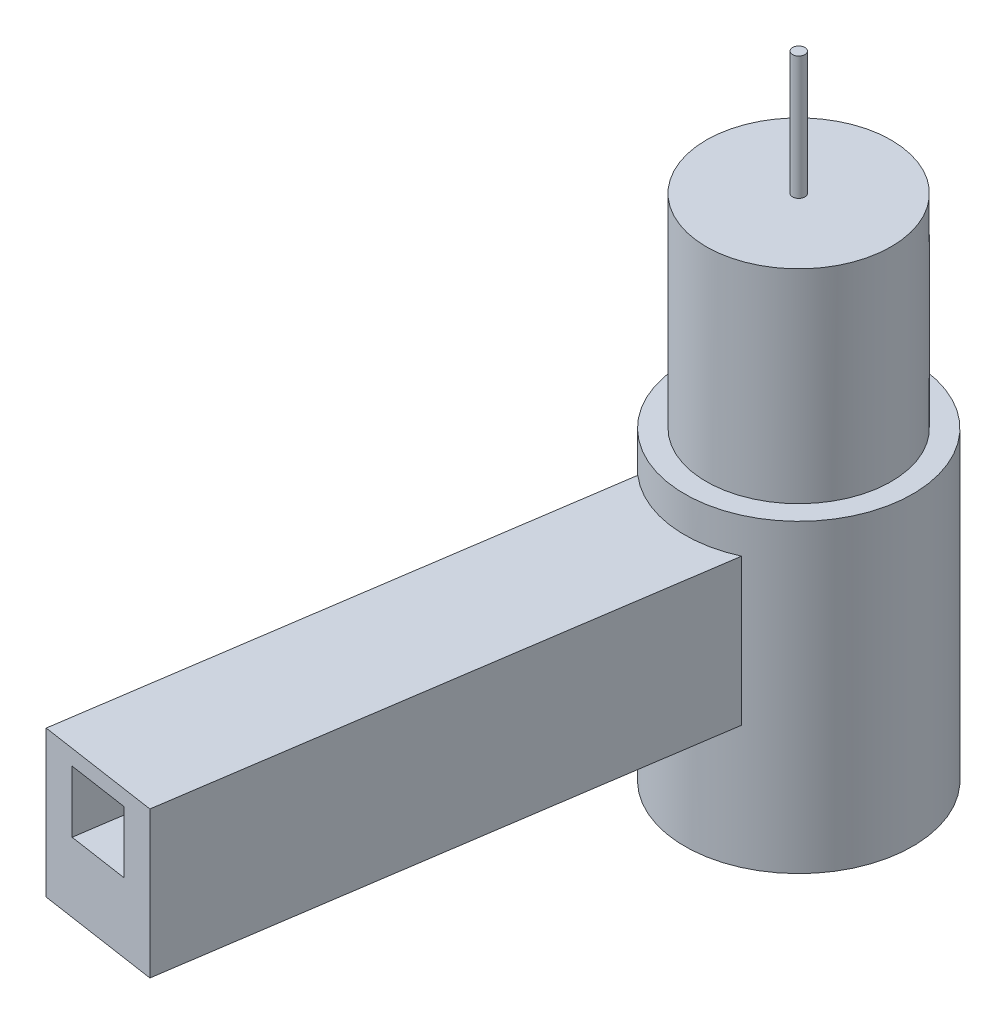
ISO-10303-21;
HEADER;
FILE_DESCRIPTION(('STEP AP214'),'2;1');
FILE_NAME('part.step','',(''),(''),'','','');
FILE_SCHEMA(('AUTOMOTIVE_DESIGN { 1 0 10303 214 1 1 1 1 }'));
ENDSEC;
DATA;
#1=APPLICATION_CONTEXT('core data for automotive mechanical design processes');
#2=APPLICATION_PROTOCOL_DEFINITION('international standard','automotive_design',2000,#1);
#3=PRODUCT_CONTEXT('',#1,'mechanical');
#4=PRODUCT('Part','Part','',(#3));
#5=PRODUCT_RELATED_PRODUCT_CATEGORY('part','',(#4));
#6=PRODUCT_DEFINITION_FORMATION('','',#4);
#7=PRODUCT_DEFINITION_CONTEXT('part definition',#1,'design');
#8=PRODUCT_DEFINITION('design','',#6,#7);
#9=PRODUCT_DEFINITION_SHAPE('','',#8);
#10=(LENGTH_UNIT() NAMED_UNIT(*) SI_UNIT(.MILLI.,.METRE.));
#11=(NAMED_UNIT(*) PLANE_ANGLE_UNIT() SI_UNIT($,.RADIAN.));
#12=(NAMED_UNIT(*) SI_UNIT($,.STERADIAN.) SOLID_ANGLE_UNIT());
#13=UNCERTAINTY_MEASURE_WITH_UNIT(LENGTH_MEASURE(1.E-05),#10,'distance_accuracy_value','');
#14=(GEOMETRIC_REPRESENTATION_CONTEXT(3) GLOBAL_UNCERTAINTY_ASSIGNED_CONTEXT((#13)) GLOBAL_UNIT_ASSIGNED_CONTEXT((#10,
#11,#12)) REPRESENTATION_CONTEXT('',''));
#15=CARTESIAN_POINT('',(0.,0.,0.));
#16=DIRECTION('',(0.,0.,1.));
#17=DIRECTION('',(1.,0.,0.));
#18=AXIS2_PLACEMENT_3D('',#15,#16,#17);
#19=CARTESIAN_POINT('',(0.,16.5,0.));
#20=DIRECTION('',(0.,1.,0.));
#21=DIRECTION('',(0.,0.,1.));
#22=AXIS2_PLACEMENT_3D('',#19,#20,#21);
#23=PLANE('',#22);
#24=CARTESIAN_POINT('',(0.,16.5,0.));
#25=DIRECTION('',(0.,1.,0.));
#26=DIRECTION('',(0.,0.,1.));
#27=AXIS2_PLACEMENT_3D('',#24,#25,#26);
#28=CIRCLE('',#27,3.);
#29=CARTESIAN_POINT('',(0.,16.5,3.));
#30=VERTEX_POINT('',#29);
#31=EDGE_CURVE('E41',#30,#30,#28,.T.);
#32=ORIENTED_EDGE('',*,*,#31,.T.);
#33=EDGE_LOOP('',(#32));
#34=FACE_BOUND('',#33,.T.);
#35=CARTESIAN_POINT('',(0.,16.5,0.));
#36=DIRECTION('',(0.,1.,0.));
#37=DIRECTION('',(0.,0.,1.));
#38=AXIS2_PLACEMENT_3D('',#35,#36,#37);
#39=CIRCLE('',#38,0.2);
#40=CARTESIAN_POINT('',(0.,16.5,0.2));
#41=VERTEX_POINT('',#40);
#42=EDGE_CURVE('E134',#41,#41,#39,.T.);
#43=ORIENTED_EDGE('',*,*,#42,.F.);
#44=EDGE_LOOP('',(#43));
#45=FACE_BOUND('',#44,.T.);
#46=ADVANCED_FACE('F33',(#34,#45),#23,.T.);
#47=CARTESIAN_POINT('',(0.,16.5,0.));
#48=DIRECTION('',(0.,-1.,0.));
#49=DIRECTION('',(0.,0.,-1.));
#50=AXIS2_PLACEMENT_3D('',#47,#48,#49);
#51=CYLINDRICAL_SURFACE('',#50,3.);
#52=ORIENTED_EDGE('',*,*,#31,.F.);
#53=EDGE_LOOP('',(#52));
#54=FACE_BOUND('',#53,.T.);
#55=CARTESIAN_POINT('',(0.,9.9,0.));
#56=DIRECTION('',(0.,-1.,0.));
#57=DIRECTION('',(0.,0.,-1.));
#58=AXIS2_PLACEMENT_3D('',#55,#56,#57);
#59=CIRCLE('',#58,3.);
#60=CARTESIAN_POINT('',(0.,9.9,-3.));
#61=VERTEX_POINT('',#60);
#62=EDGE_CURVE('E11',#61,#61,#59,.T.);
#63=ORIENTED_EDGE('',*,*,#62,.F.);
#64=EDGE_LOOP('',(#63));
#65=FACE_BOUND('',#64,.T.);
#66=ADVANCED_FACE('F35',(#54,#65),#51,.T.);
#67=CARTESIAN_POINT('',(0.,9.9,0.));
#68=DIRECTION('',(0.,-1.,0.));
#69=DIRECTION('',(0.,0.,-1.));
#70=AXIS2_PLACEMENT_3D('',#67,#68,#69);
#71=PLANE('',#70);
#72=CARTESIAN_POINT('',(0.,9.9,0.));
#73=DIRECTION('',(0.,-1.,0.));
#74=DIRECTION('',(0.,0.,-1.));
#75=AXIS2_PLACEMENT_3D('',#72,#73,#74);
#76=CIRCLE('',#75,3.7);
#77=CARTESIAN_POINT('',(0.,9.9,-3.7));
#78=VERTEX_POINT('',#77);
#79=EDGE_CURVE('E173',#78,#78,#76,.T.);
#80=ORIENTED_EDGE('',*,*,#79,.F.);
#81=EDGE_LOOP('',(#80));
#82=FACE_BOUND('',#81,.T.);
#83=ORIENTED_EDGE('',*,*,#62,.T.);
#84=EDGE_LOOP('',(#83));
#85=FACE_BOUND('',#84,.T.);
#86=ADVANCED_FACE('F184',(#82,#85),#71,.F.);
#87=CARTESIAN_POINT('',(0.,9.9,0.));
#88=DIRECTION('',(0.,-1.,0.));
#89=DIRECTION('',(0.,0.,-1.));
#90=AXIS2_PLACEMENT_3D('',#87,#88,#89);
#91=CYLINDRICAL_SURFACE('',#90,3.7);
#92=CARTESIAN_POINT('',(0.,4.,0.));
#93=DIRECTION('',(0.,1.,0.));
#94=DIRECTION('',(0.,0.,-1.));
#95=AXIS2_PLACEMENT_3D('',#92,#93,#94);
#96=CIRCLE('',#95,3.7);
#97=CARTESIAN_POINT('',(-2.4381167249235,4.,2.783089440828));
#98=VERTEX_POINT('',#97);
#99=CARTESIAN_POINT('',(1.51795255805528,4.,3.37428807772742));
#100=VERTEX_POINT('',#99);
#101=EDGE_CURVE('E149',#98,#100,#96,.T.);
#102=ORIENTED_EDGE('',*,*,#101,.F.);
#103=DIRECTION('',(0.,1.,0.));
#104=VECTOR('',#103,1.);
#105=CARTESIAN_POINT('',(-2.4381167249235,4.,2.783089440828));
#106=LINE('',#105,#104);
#107=CARTESIAN_POINT('',(-2.4381167249235,8.75,2.783089440828));
#108=VERTEX_POINT('',#107);
#109=EDGE_CURVE('E166',#98,#108,#106,.T.);
#110=ORIENTED_EDGE('',*,*,#109,.T.);
#111=CARTESIAN_POINT('',(0.,8.75,0.));
#112=DIRECTION('',(0.,1.,0.));
#113=DIRECTION('',(0.,0.,-1.));
#114=AXIS2_PLACEMENT_3D('',#111,#112,#113);
#115=CIRCLE('',#114,3.7);
#116=CARTESIAN_POINT('',(1.51795255805528,8.75,3.37428807772743));
#117=VERTEX_POINT('',#116);
#118=EDGE_CURVE('E158',#108,#117,#115,.T.);
#119=ORIENTED_EDGE('',*,*,#118,.T.);
#120=DIRECTION('',(0.,1.,0.));
#121=VECTOR('',#120,1.);
#122=CARTESIAN_POINT('',(1.51795255805528,4.,3.37428807772742));
#123=LINE('',#122,#121);
#124=EDGE_CURVE('E164',#100,#117,#123,.T.);
#125=ORIENTED_EDGE('',*,*,#124,.F.);
#126=EDGE_LOOP('',(#102,#110,#119,#125));
#127=FACE_BOUND('',#126,.T.);
#128=ORIENTED_EDGE('',*,*,#79,.T.);
#129=EDGE_LOOP('',(#128));
#130=FACE_BOUND('',#129,.T.);
#131=CARTESIAN_POINT('',(0.,0.,0.));
#132=DIRECTION('',(0.,-1.,0.));
#133=DIRECTION('',(0.,0.,-1.));
#134=AXIS2_PLACEMENT_3D('',#131,#132,#133);
#135=CIRCLE('',#134,3.7);
#136=CARTESIAN_POINT('',(0.,0.,-3.7));
#137=VERTEX_POINT('',#136);
#138=EDGE_CURVE('E172',#137,#137,#135,.T.);
#139=ORIENTED_EDGE('',*,*,#138,.F.);
#140=EDGE_LOOP('',(#139));
#141=FACE_BOUND('',#140,.T.);
#142=ADVANCED_FACE('F188',(#127,#130,#141),#91,.T.);
#143=CARTESIAN_POINT('',(0.,0.,0.));
#144=DIRECTION('',(0.,1.,0.));
#145=DIRECTION('',(0.,0.,1.));
#146=AXIS2_PLACEMENT_3D('',#143,#144,#145);
#147=PLANE('',#146);
#148=ORIENTED_EDGE('',*,*,#138,.T.);
#149=EDGE_LOOP('',(#148));
#150=FACE_BOUND('',#149,.T.);
#151=ADVANCED_FACE('F194',(#150),#147,.F.);
#152=CARTESIAN_POINT('',(-4.93402782598654,4.,19.4847470964442));
#153=DIRECTION('',(0.147799659224858,0.,-0.989017320744696));
#154=DIRECTION('',(-0.989017320744696,0.,-0.147799659224858));
#155=AXIS2_PLACEMENT_3D('',#152,#153,#154);
#156=PLANE('',#155);
#157=DIRECTION('',(0.,-1.,0.));
#158=VECTOR('',#157,1.);
#159=CARTESIAN_POINT('',(-1.96697586375245,4.,19.9281460741188));
#160=LINE('',#159,#158);
#161=CARTESIAN_POINT('',(-1.96697586375245,8.25,19.9281460741188));
#162=VERTEX_POINT('',#161);
#163=CARTESIAN_POINT('',(-1.96697586375245,6.25,19.9281460741188));
#164=VERTEX_POINT('',#163);
#165=EDGE_CURVE('E128',#162,#164,#160,.T.);
#166=ORIENTED_EDGE('',*,*,#165,.T.);
#167=DIRECTION('',(0.989017320744696,0.,0.147799659224858));
#168=VECTOR('',#167,1.);
#169=CARTESIAN_POINT('',(-4.93402782598654,6.25,19.4847470964442));
#170=LINE('',#169,#168);
#171=CARTESIAN_POINT('',(-3.94501050524184,6.25,19.6325467556691));
#172=VERTEX_POINT('',#171);
#173=EDGE_CURVE('E48',#172,#164,#170,.T.);
#174=ORIENTED_EDGE('',*,*,#173,.F.);
#175=DIRECTION('',(0.,-1.,0.));
#176=VECTOR('',#175,1.);
#177=CARTESIAN_POINT('',(-3.94501050524184,4.,19.6325467556691));
#178=LINE('',#177,#176);
#179=CARTESIAN_POINT('',(-3.94501050524184,8.25,19.6325467556691));
#180=VERTEX_POINT('',#179);
#181=EDGE_CURVE('E119',#180,#172,#178,.T.);
#182=ORIENTED_EDGE('',*,*,#181,.F.);
#183=DIRECTION('',(0.989017320744696,0.,0.147799659224858));
#184=VECTOR('',#183,1.);
#185=CARTESIAN_POINT('',(-4.93402782598654,8.25,19.4847470964442));
#186=LINE('',#185,#184);
#187=EDGE_CURVE('E122',#180,#162,#186,.T.);
#188=ORIENTED_EDGE('',*,*,#187,.T.);
#189=EDGE_LOOP('',(#166,#174,#182,#188));
#190=FACE_BOUND('',#189,.T.);
#191=DIRECTION('',(-0.989017320744696,0.,-0.147799659224858));
#192=VECTOR('',#191,1.);
#193=CARTESIAN_POINT('',(-4.93402782598654,8.75,19.4847470964442));
#194=LINE('',#193,#192);
#195=CARTESIAN_POINT('',(-0.977958543007756,8.75,20.0759457333436));
#196=VERTEX_POINT('',#195);
#197=CARTESIAN_POINT('',(-4.93402782598654,8.75,19.4847470964442));
#198=VERTEX_POINT('',#197);
#199=EDGE_CURVE('E141',#196,#198,#194,.T.);
#200=ORIENTED_EDGE('',*,*,#199,.T.);
#201=DIRECTION('',(0.,1.,0.));
#202=VECTOR('',#201,1.);
#203=CARTESIAN_POINT('',(-4.93402782598654,4.,19.4847470964442));
#204=LINE('',#203,#202);
#205=CARTESIAN_POINT('',(-4.93402782598654,4.,19.4847470964442));
#206=VERTEX_POINT('',#205);
#207=EDGE_CURVE('E169',#206,#198,#204,.T.);
#208=ORIENTED_EDGE('',*,*,#207,.F.);
#209=DIRECTION('',(-0.989017320744696,0.,-0.147799659224858));
#210=VECTOR('',#209,1.);
#211=CARTESIAN_POINT('',(-4.93402782598654,4.,19.4847470964442));
#212=LINE('',#211,#210);
#213=CARTESIAN_POINT('',(-0.977958543007756,4.,20.0759457333436));
#214=VERTEX_POINT('',#213);
#215=EDGE_CURVE('E144',#214,#206,#212,.T.);
#216=ORIENTED_EDGE('',*,*,#215,.F.);
#217=DIRECTION('',(0.,1.,0.));
#218=VECTOR('',#217,1.);
#219=CARTESIAN_POINT('',(-0.977958543007756,4.,20.0759457333436));
#220=LINE('',#219,#218);
#221=EDGE_CURVE('E153',#214,#196,#220,.T.);
#222=ORIENTED_EDGE('',*,*,#221,.T.);
#223=EDGE_LOOP('',(#200,#208,#216,#222));
#224=FACE_BOUND('',#223,.T.);
#225=ADVANCED_FACE('F204',(#190,#224),#156,.F.);
#226=CARTESIAN_POINT('',(-2.4381167249235,4.,2.783089440828));
#227=DIRECTION('',(0.989017320744696,0.,0.147799659224857));
#228=DIRECTION('',(0.147799659224857,0.,-0.989017320744696));
#229=AXIS2_PLACEMENT_3D('',#226,#227,#228);
#230=PLANE('',#229);
#231=DIRECTION('',(0.147799659224857,0.,-0.989017320744696));
#232=VECTOR('',#231,1.);
#233=CARTESIAN_POINT('',(-2.4381167249235,8.75,2.783089440828));
#234=LINE('',#233,#232);
#235=EDGE_CURVE('E156',#198,#108,#234,.T.);
#236=ORIENTED_EDGE('',*,*,#235,.T.);
#237=ORIENTED_EDGE('',*,*,#109,.F.);
#238=DIRECTION('',(0.147799659224857,0.,-0.989017320744696));
#239=VECTOR('',#238,1.);
#240=CARTESIAN_POINT('',(-2.4381167249235,4.,2.783089440828));
#241=LINE('',#240,#239);
#242=EDGE_CURVE('E147',#206,#98,#241,.T.);
#243=ORIENTED_EDGE('',*,*,#242,.F.);
#244=ORIENTED_EDGE('',*,*,#207,.T.);
#245=EDGE_LOOP('',(#236,#237,#243,#244));
#246=FACE_BOUND('',#245,.T.);
#247=ADVANCED_FACE('F209',(#246),#230,.F.);
#248=CARTESIAN_POINT('',(1.51795255805528,4.,3.37428807772742));
#249=DIRECTION('',(-0.989017320744696,0.,-0.147799659224857));
#250=DIRECTION('',(-0.147799659224857,0.,0.989017320744696));
#251=AXIS2_PLACEMENT_3D('',#248,#249,#250);
#252=PLANE('',#251);
#253=DIRECTION('',(-0.147799659224857,0.,0.989017320744696));
#254=VECTOR('',#253,1.);
#255=CARTESIAN_POINT('',(1.51795255805528,8.75,3.37428807772742));
#256=LINE('',#255,#254);
#257=EDGE_CURVE('E56',#117,#196,#256,.T.);
#258=ORIENTED_EDGE('',*,*,#257,.T.);
#259=ORIENTED_EDGE('',*,*,#221,.F.);
#260=DIRECTION('',(-0.147799659224857,0.,0.989017320744696));
#261=VECTOR('',#260,1.);
#262=CARTESIAN_POINT('',(1.51795255805528,4.,3.37428807772742));
#263=LINE('',#262,#261);
#264=EDGE_CURVE('E151',#100,#214,#263,.T.);
#265=ORIENTED_EDGE('',*,*,#264,.F.);
#266=ORIENTED_EDGE('',*,*,#124,.T.);
#267=EDGE_LOOP('',(#258,#259,#265,#266));
#268=FACE_BOUND('',#267,.T.);
#269=ADVANCED_FACE('F216',(#268),#252,.F.);
#270=CARTESIAN_POINT('',(0.,4.,0.));
#271=DIRECTION('',(0.,-1.,0.));
#272=DIRECTION('',(0.,0.,-1.));
#273=AXIS2_PLACEMENT_3D('',#270,#271,#272);
#274=PLANE('',#273);
#275=ORIENTED_EDGE('',*,*,#215,.T.);
#276=ORIENTED_EDGE('',*,*,#242,.T.);
#277=ORIENTED_EDGE('',*,*,#101,.T.);
#278=ORIENTED_EDGE('',*,*,#264,.T.);
#279=EDGE_LOOP('',(#275,#276,#277,#278));
#280=FACE_BOUND('',#279,.T.);
#281=ADVANCED_FACE('F223',(#280),#274,.T.);
#282=CARTESIAN_POINT('',(0.,8.75,0.));
#283=DIRECTION('',(0.,-1.,0.));
#284=DIRECTION('',(0.,0.,-1.));
#285=AXIS2_PLACEMENT_3D('',#282,#283,#284);
#286=PLANE('',#285);
#287=ORIENTED_EDGE('',*,*,#199,.F.);
#288=ORIENTED_EDGE('',*,*,#257,.F.);
#289=ORIENTED_EDGE('',*,*,#118,.F.);
#290=ORIENTED_EDGE('',*,*,#235,.F.);
#291=EDGE_LOOP('',(#287,#288,#289,#290));
#292=FACE_BOUND('',#291,.T.);
#293=ADVANCED_FACE('F225',(#292),#286,.F.);
#294=CARTESIAN_POINT('',(0.,20.5,0.));
#295=DIRECTION('',(0.,-1.,0.));
#296=DIRECTION('',(0.,0.,-1.));
#297=AXIS2_PLACEMENT_3D('',#294,#295,#296);
#298=CYLINDRICAL_SURFACE('',#297,0.2);
#299=CARTESIAN_POINT('',(0.,20.5,0.));
#300=DIRECTION('',(0.,1.,0.));
#301=DIRECTION('',(0.,0.,1.));
#302=AXIS2_PLACEMENT_3D('',#299,#300,#301);
#303=CIRCLE('',#302,0.2);
#304=CARTESIAN_POINT('',(0.,20.5,0.2));
#305=VERTEX_POINT('',#304);
#306=EDGE_CURVE('E138',#305,#305,#303,.T.);
#307=ORIENTED_EDGE('',*,*,#306,.F.);
#308=EDGE_LOOP('',(#307));
#309=FACE_BOUND('',#308,.T.);
#310=ORIENTED_EDGE('',*,*,#42,.T.);
#311=EDGE_LOOP('',(#310));
#312=FACE_BOUND('',#311,.T.);
#313=ADVANCED_FACE('F228',(#309,#312),#298,.T.);
#314=CARTESIAN_POINT('',(0.,20.5,0.));
#315=DIRECTION('',(0.,1.,0.));
#316=DIRECTION('',(0.,0.,1.));
#317=AXIS2_PLACEMENT_3D('',#314,#315,#316);
#318=PLANE('',#317);
#319=ORIENTED_EDGE('',*,*,#306,.T.);
#320=EDGE_LOOP('',(#319));
#321=FACE_BOUND('',#320,.T.);
#322=ADVANCED_FACE('F234',(#321),#318,.T.);
#323=CARTESIAN_POINT('',(-1.97803464148939,6.25,-0.295599318449719));
#324=DIRECTION('',(0.,-1.,0.));
#325=DIRECTION('',(0.,0.,-1.));
#326=AXIS2_PLACEMENT_3D('',#323,#324,#325);
#327=PLANE('',#326);
#328=ORIENTED_EDGE('',*,*,#173,.T.);
#329=DIRECTION('',(-0.147799659224858,0.,0.989017320744696));
#330=VECTOR('',#329,1.);
#331=CARTESIAN_POINT('',(0.9890173207447,6.25,0.147799659224856));
#332=LINE('',#331,#330);
#333=CARTESIAN_POINT('',(0.9890173207447,6.25,0.147799659224856));
#334=VERTEX_POINT('',#333);
#335=EDGE_CURVE('E103',#334,#164,#332,.T.);
#336=ORIENTED_EDGE('',*,*,#335,.F.);
#337=DIRECTION('',(0.989017320744696,0.,0.147799659224858));
#338=VECTOR('',#337,1.);
#339=CARTESIAN_POINT('',(-1.97803464148939,6.25,-0.295599318449719));
#340=LINE('',#339,#338);
#341=CARTESIAN_POINT('',(-0.989017320744692,6.25,-0.147799659224863));
#342=VERTEX_POINT('',#341);
#343=EDGE_CURVE('E110',#342,#334,#340,.T.);
#344=ORIENTED_EDGE('',*,*,#343,.F.);
#345=DIRECTION('',(-0.147799659224858,0.,0.989017320744696));
#346=VECTOR('',#345,1.);
#347=CARTESIAN_POINT('',(-0.989017320744692,6.25,-0.147799659224863));
#348=LINE('',#347,#346);
#349=EDGE_CURVE('E132',#342,#172,#348,.T.);
#350=ORIENTED_EDGE('',*,*,#349,.T.);
#351=EDGE_LOOP('',(#328,#336,#344,#350));
#352=FACE_BOUND('',#351,.T.);
#353=ADVANCED_FACE('F113',(#352),#327,.F.);
#354=CARTESIAN_POINT('',(-0.989017320744692,4.,-0.147799659224863));
#355=DIRECTION('',(-0.989017320744696,0.,-0.147799659224858));
#356=DIRECTION('',(-0.147799659224858,0.,0.989017320744696));
#357=AXIS2_PLACEMENT_3D('',#354,#355,#356);
#358=PLANE('',#357);
#359=ORIENTED_EDGE('',*,*,#181,.T.);
#360=ORIENTED_EDGE('',*,*,#349,.F.);
#361=DIRECTION('',(0.,-1.,0.));
#362=VECTOR('',#361,1.);
#363=CARTESIAN_POINT('',(-0.989017320744692,4.,-0.147799659224863));
#364=LINE('',#363,#362);
#365=CARTESIAN_POINT('',(-0.989017320744692,8.25,-0.147799659224863));
#366=VERTEX_POINT('',#365);
#367=EDGE_CURVE('E115',#366,#342,#364,.T.);
#368=ORIENTED_EDGE('',*,*,#367,.F.);
#369=DIRECTION('',(-0.147799659224858,0.,0.989017320744696));
#370=VECTOR('',#369,1.);
#371=CARTESIAN_POINT('',(-0.989017320744692,8.25,-0.147799659224863));
#372=LINE('',#371,#370);
#373=EDGE_CURVE('E135',#366,#180,#372,.T.);
#374=ORIENTED_EDGE('',*,*,#373,.T.);
#375=EDGE_LOOP('',(#359,#360,#368,#374));
#376=FACE_BOUND('',#375,.T.);
#377=ADVANCED_FACE('F241',(#376),#358,.F.);
#378=CARTESIAN_POINT('',(-1.97803464148939,8.25,-0.295599318449719));
#379=DIRECTION('',(0.,-1.,0.));
#380=DIRECTION('',(0.,0.,-1.));
#381=AXIS2_PLACEMENT_3D('',#378,#379,#380);
#382=PLANE('',#381);
#383=ORIENTED_EDGE('',*,*,#187,.F.);
#384=ORIENTED_EDGE('',*,*,#373,.F.);
#385=DIRECTION('',(0.989017320744696,0.,0.147799659224858));
#386=VECTOR('',#385,1.);
#387=CARTESIAN_POINT('',(-1.97803464148939,8.25,-0.295599318449719));
#388=LINE('',#387,#386);
#389=CARTESIAN_POINT('',(0.9890173207447,8.25,0.147799659224856));
#390=VERTEX_POINT('',#389);
#391=EDGE_CURVE('E109',#366,#390,#388,.T.);
#392=ORIENTED_EDGE('',*,*,#391,.T.);
#393=DIRECTION('',(-0.147799659224858,0.,0.989017320744696));
#394=VECTOR('',#393,1.);
#395=CARTESIAN_POINT('',(0.9890173207447,8.25,0.147799659224856));
#396=LINE('',#395,#394);
#397=EDGE_CURVE('E105',#390,#162,#396,.T.);
#398=ORIENTED_EDGE('',*,*,#397,.T.);
#399=EDGE_LOOP('',(#383,#384,#392,#398));
#400=FACE_BOUND('',#399,.T.);
#401=ADVANCED_FACE('F244',(#400),#382,.T.);
#402=CARTESIAN_POINT('',(0.9890173207447,4.,0.147799659224856));
#403=DIRECTION('',(-0.989017320744696,0.,-0.147799659224858));
#404=DIRECTION('',(-0.147799659224858,0.,0.989017320744696));
#405=AXIS2_PLACEMENT_3D('',#402,#403,#404);
#406=PLANE('',#405);
#407=ORIENTED_EDGE('',*,*,#165,.F.);
#408=ORIENTED_EDGE('',*,*,#397,.F.);
#409=DIRECTION('',(0.,-1.,0.));
#410=VECTOR('',#409,1.);
#411=CARTESIAN_POINT('',(0.9890173207447,4.,0.147799659224856));
#412=LINE('',#411,#410);
#413=EDGE_CURVE('E100',#390,#334,#412,.T.);
#414=ORIENTED_EDGE('',*,*,#413,.T.);
#415=ORIENTED_EDGE('',*,*,#335,.T.);
#416=EDGE_LOOP('',(#407,#408,#414,#415));
#417=FACE_BOUND('',#416,.T.);
#418=ADVANCED_FACE('F102',(#417),#406,.T.);
#419=CARTESIAN_POINT('',(0.,0.,0.));
#420=DIRECTION('',(0.147799659224858,0.,-0.989017320744696));
#421=DIRECTION('',(-0.989017320744696,0.,-0.147799659224858));
#422=AXIS2_PLACEMENT_3D('',#419,#420,#421);
#423=PLANE('',#422);
#424=ORIENTED_EDGE('',*,*,#343,.T.);
#425=ORIENTED_EDGE('',*,*,#413,.F.);
#426=ORIENTED_EDGE('',*,*,#391,.F.);
#427=ORIENTED_EDGE('',*,*,#367,.T.);
#428=EDGE_LOOP('',(#424,#425,#426,#427));
#429=FACE_BOUND('',#428,.T.);
#430=ADVANCED_FACE('F117',(#429),#423,.F.);
#431=CLOSED_SHELL('',(#46,#66,#86,#142,#151,#225,#247,#269,#281,#293,#313,#322,#353,#377,#401,
#418,#430));
#432=MANIFOLD_SOLID_BREP('B2',#431);
#433=ADVANCED_BREP_SHAPE_REPRESENTATION('',(#18,#432),#14);
#434=SHAPE_DEFINITION_REPRESENTATION(#9,#433);
ENDSEC;
END-ISO-10303-21;
